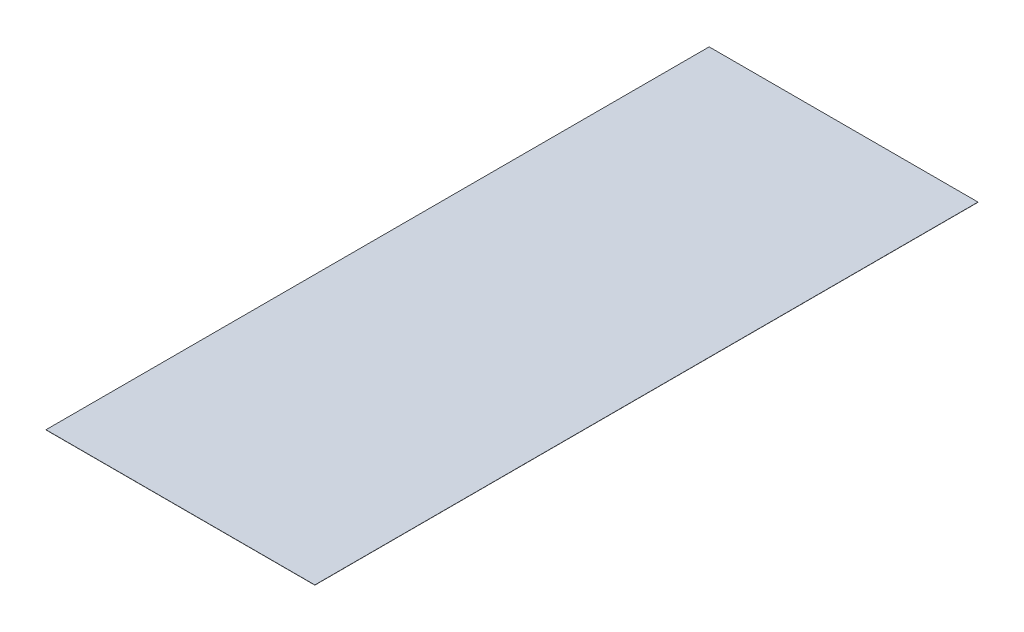
ISO-10303-21;
HEADER;
FILE_DESCRIPTION(('STEP AP214'),'2;1');
FILE_NAME('part.step','',(''),(''),'','','');
FILE_SCHEMA(('AUTOMOTIVE_DESIGN { 1 0 10303 214 1 1 1 1 }'));
ENDSEC;
DATA;
#1=APPLICATION_CONTEXT('core data for automotive mechanical design processes');
#2=APPLICATION_PROTOCOL_DEFINITION('international standard','automotive_design',2000,#1);
#3=PRODUCT_CONTEXT('',#1,'mechanical');
#4=PRODUCT('Part','Part','',(#3));
#5=PRODUCT_RELATED_PRODUCT_CATEGORY('part','',(#4));
#6=PRODUCT_DEFINITION_FORMATION('','',#4);
#7=PRODUCT_DEFINITION_CONTEXT('part definition',#1,'design');
#8=PRODUCT_DEFINITION('design','',#6,#7);
#9=PRODUCT_DEFINITION_SHAPE('','',#8);
#10=(LENGTH_UNIT() NAMED_UNIT(*) SI_UNIT(.MILLI.,.METRE.));
#11=(NAMED_UNIT(*) PLANE_ANGLE_UNIT() SI_UNIT($,.RADIAN.));
#12=(NAMED_UNIT(*) SI_UNIT($,.STERADIAN.) SOLID_ANGLE_UNIT());
#13=UNCERTAINTY_MEASURE_WITH_UNIT(LENGTH_MEASURE(1.E-05),#10,'distance_accuracy_value','');
#14=(GEOMETRIC_REPRESENTATION_CONTEXT(3) GLOBAL_UNCERTAINTY_ASSIGNED_CONTEXT((#13)) GLOBAL_UNIT_ASSIGNED_CONTEXT((#10,
#11,#12)) REPRESENTATION_CONTEXT('',''));
#15=CARTESIAN_POINT('',(0.,0.,0.));
#16=DIRECTION('',(0.,0.,1.));
#17=DIRECTION('',(1.,0.,0.));
#18=AXIS2_PLACEMENT_3D('',#15,#16,#17);
#19=CARTESIAN_POINT('',(0.,0.,0.));
#20=DIRECTION('',(0.,1.,0.));
#21=DIRECTION('',(0.,0.,1.));
#22=AXIS2_PLACEMENT_3D('',#19,#20,#21);
#23=PLANE('',#22);
#24=DIRECTION('',(0.,0.,-1.));
#25=VECTOR('',#24,1.);
#26=CARTESIAN_POINT('',(4572.,0.,11277.6));
#27=LINE('',#26,#25);
#28=CARTESIAN_POINT('',(4572.,0.,11277.6));
#29=VERTEX_POINT('',#28);
#30=CARTESIAN_POINT('',(4572.,0.,-11277.6));
#31=VERTEX_POINT('',#30);
#32=EDGE_CURVE('E20',#29,#31,#27,.T.);
#33=ORIENTED_EDGE('',*,*,#32,.F.);
#34=DIRECTION('',(1.,0.,0.));
#35=VECTOR('',#34,1.);
#36=CARTESIAN_POINT('',(-4572.,0.,11277.6));
#37=LINE('',#36,#35);
#38=CARTESIAN_POINT('',(-4572.,0.,11277.6));
#39=VERTEX_POINT('',#38);
#40=EDGE_CURVE('E80',#39,#29,#37,.T.);
#41=ORIENTED_EDGE('',*,*,#40,.F.);
#42=DIRECTION('',(0.,0.,1.));
#43=VECTOR('',#42,1.);
#44=CARTESIAN_POINT('',(-4572.,0.,-11277.6));
#45=LINE('',#44,#43);
#46=CARTESIAN_POINT('',(-4572.,0.,-11277.6));
#47=VERTEX_POINT('',#46);
#48=EDGE_CURVE('E68',#47,#39,#45,.T.);
#49=ORIENTED_EDGE('',*,*,#48,.F.);
#50=DIRECTION('',(-1.,0.,0.));
#51=VECTOR('',#50,1.);
#52=CARTESIAN_POINT('',(4572.,0.,-11277.6));
#53=LINE('',#52,#51);
#54=EDGE_CURVE('E55',#31,#47,#53,.T.);
#55=ORIENTED_EDGE('',*,*,#54,.F.);
#56=EDGE_LOOP('',(#33,#41,#49,#55));
#57=FACE_BOUND('',#56,.T.);
#58=ADVANCED_FACE('F17',(#57),#23,.F.);
#59=CARTESIAN_POINT('',(4572.,0.,11277.6));
#60=DIRECTION('',(1.,0.,0.));
#61=DIRECTION('',(0.,0.,-1.));
#62=AXIS2_PLACEMENT_3D('',#59,#60,#61);
#63=PLANE('',#62);
#64=ORIENTED_EDGE('',*,*,#32,.T.);
#65=DIRECTION('',(0.,1.,0.));
#66=VECTOR('',#65,1.);
#67=CARTESIAN_POINT('',(4572.,0.,-11277.6));
#68=LINE('',#67,#66);
#69=CARTESIAN_POINT('',(4572.,6.35,-11277.6));
#70=VERTEX_POINT('',#69);
#71=EDGE_CURVE('E61',#70,#31,#68,.F.);
#72=ORIENTED_EDGE('',*,*,#71,.F.);
#73=DIRECTION('',(0.,0.,1.));
#74=VECTOR('',#73,1.);
#75=CARTESIAN_POINT('',(4572.,6.35,0.));
#76=LINE('',#75,#74);
#77=CARTESIAN_POINT('',(4572.,6.35,11277.6));
#78=VERTEX_POINT('',#77);
#79=EDGE_CURVE('E83',#78,#70,#76,.F.);
#80=ORIENTED_EDGE('',*,*,#79,.F.);
#81=DIRECTION('',(0.,1.,0.));
#82=VECTOR('',#81,1.);
#83=CARTESIAN_POINT('',(4572.,0.,11277.6));
#84=LINE('',#83,#82);
#85=EDGE_CURVE('E64',#29,#78,#84,.T.);
#86=ORIENTED_EDGE('',*,*,#85,.F.);
#87=EDGE_LOOP('',(#64,#72,#80,#86));
#88=FACE_BOUND('',#87,.T.);
#89=ADVANCED_FACE('F60',(#88),#63,.T.);
#90=CARTESIAN_POINT('',(4572.,0.,-11277.6));
#91=DIRECTION('',(0.,0.,-1.));
#92=DIRECTION('',(-1.,0.,0.));
#93=AXIS2_PLACEMENT_3D('',#90,#91,#92);
#94=PLANE('',#93);
#95=ORIENTED_EDGE('',*,*,#54,.T.);
#96=DIRECTION('',(0.,1.,0.));
#97=VECTOR('',#96,1.);
#98=CARTESIAN_POINT('',(-4572.,0.,-11277.6));
#99=LINE('',#98,#97);
#100=CARTESIAN_POINT('',(-4572.,6.35,-11277.6));
#101=VERTEX_POINT('',#100);
#102=EDGE_CURVE('E70',#101,#47,#99,.F.);
#103=ORIENTED_EDGE('',*,*,#102,.F.);
#104=DIRECTION('',(1.,0.,0.));
#105=VECTOR('',#104,1.);
#106=CARTESIAN_POINT('',(0.,6.35,-11277.6));
#107=LINE('',#106,#105);
#108=EDGE_CURVE('E74',#70,#101,#107,.F.);
#109=ORIENTED_EDGE('',*,*,#108,.F.);
#110=ORIENTED_EDGE('',*,*,#71,.T.);
#111=EDGE_LOOP('',(#95,#103,#109,#110));
#112=FACE_BOUND('',#111,.T.);
#113=ADVANCED_FACE('F72',(#112),#94,.T.);
#114=CARTESIAN_POINT('',(-4572.,0.,-11277.6));
#115=DIRECTION('',(-1.,0.,0.));
#116=DIRECTION('',(0.,0.,1.));
#117=AXIS2_PLACEMENT_3D('',#114,#115,#116);
#118=PLANE('',#117);
#119=ORIENTED_EDGE('',*,*,#48,.T.);
#120=DIRECTION('',(0.,1.,0.));
#121=VECTOR('',#120,1.);
#122=CARTESIAN_POINT('',(-4572.,0.,11277.6));
#123=LINE('',#122,#121);
#124=CARTESIAN_POINT('',(-4572.,6.35,11277.6));
#125=VERTEX_POINT('',#124);
#126=EDGE_CURVE('E35',#125,#39,#123,.F.);
#127=ORIENTED_EDGE('',*,*,#126,.F.);
#128=DIRECTION('',(0.,0.,1.));
#129=VECTOR('',#128,1.);
#130=CARTESIAN_POINT('',(-4572.,6.35,0.));
#131=LINE('',#130,#129);
#132=EDGE_CURVE('E26',#101,#125,#131,.T.);
#133=ORIENTED_EDGE('',*,*,#132,.F.);
#134=ORIENTED_EDGE('',*,*,#102,.T.);
#135=EDGE_LOOP('',(#119,#127,#133,#134));
#136=FACE_BOUND('',#135,.T.);
#137=ADVANCED_FACE('F89',(#136),#118,.T.);
#138=CARTESIAN_POINT('',(-4572.,0.,11277.6));
#139=DIRECTION('',(0.,0.,1.));
#140=DIRECTION('',(1.,0.,0.));
#141=AXIS2_PLACEMENT_3D('',#138,#139,#140);
#142=PLANE('',#141);
#143=ORIENTED_EDGE('',*,*,#40,.T.);
#144=ORIENTED_EDGE('',*,*,#85,.T.);
#145=DIRECTION('',(1.,0.,0.));
#146=VECTOR('',#145,1.);
#147=CARTESIAN_POINT('',(0.,6.35,11277.6));
#148=LINE('',#147,#146);
#149=EDGE_CURVE('E11',#125,#78,#148,.T.);
#150=ORIENTED_EDGE('',*,*,#149,.F.);
#151=ORIENTED_EDGE('',*,*,#126,.T.);
#152=EDGE_LOOP('',(#143,#144,#150,#151));
#153=FACE_BOUND('',#152,.T.);
#154=ADVANCED_FACE('F91',(#153),#142,.T.);
#155=CARTESIAN_POINT('',(0.,6.35,0.));
#156=DIRECTION('',(0.,1.,0.));
#157=DIRECTION('',(0.,0.,1.));
#158=AXIS2_PLACEMENT_3D('',#155,#156,#157);
#159=PLANE('',#158);
#160=ORIENTED_EDGE('',*,*,#132,.T.);
#161=ORIENTED_EDGE('',*,*,#149,.T.);
#162=ORIENTED_EDGE('',*,*,#79,.T.);
#163=ORIENTED_EDGE('',*,*,#108,.T.);
#164=EDGE_LOOP('',(#160,#161,#162,#163));
#165=FACE_BOUND('',#164,.T.);
#166=ADVANCED_FACE('F88',(#165),#159,.T.);
#167=CLOSED_SHELL('',(#58,#89,#113,#137,#154,#166));
#168=MANIFOLD_SOLID_BREP('B1',#167);
#169=ADVANCED_BREP_SHAPE_REPRESENTATION('',(#18,#168),#14);
#170=SHAPE_DEFINITION_REPRESENTATION(#9,#169);
ENDSEC;
END-ISO-10303-21;
